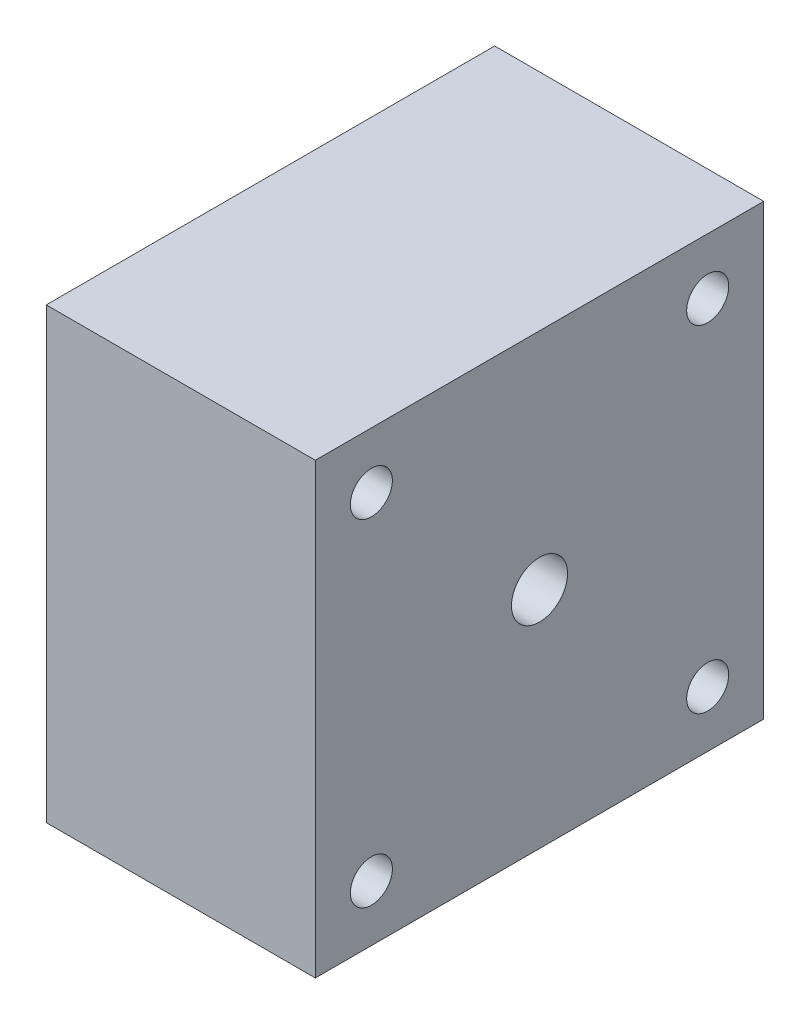
ISO-10303-21;
HEADER;
FILE_DESCRIPTION(('STEP AP214'),'2;1');
FILE_NAME('part.step','',(''),(''),'','','');
FILE_SCHEMA(('AUTOMOTIVE_DESIGN { 1 0 10303 214 1 1 1 1 }'));
ENDSEC;
DATA;
#1=APPLICATION_CONTEXT('core data for automotive mechanical design processes');
#2=APPLICATION_PROTOCOL_DEFINITION('international standard','automotive_design',2000,#1);
#3=PRODUCT_CONTEXT('',#1,'mechanical');
#4=PRODUCT('Part','Part','',(#3));
#5=PRODUCT_RELATED_PRODUCT_CATEGORY('part','',(#4));
#6=PRODUCT_DEFINITION_FORMATION('','',#4);
#7=PRODUCT_DEFINITION_CONTEXT('part definition',#1,'design');
#8=PRODUCT_DEFINITION('design','',#6,#7);
#9=PRODUCT_DEFINITION_SHAPE('','',#8);
#10=(LENGTH_UNIT() NAMED_UNIT(*) SI_UNIT(.MILLI.,.METRE.));
#11=(NAMED_UNIT(*) PLANE_ANGLE_UNIT() SI_UNIT($,.RADIAN.));
#12=(NAMED_UNIT(*) SI_UNIT($,.STERADIAN.) SOLID_ANGLE_UNIT());
#13=UNCERTAINTY_MEASURE_WITH_UNIT(LENGTH_MEASURE(1.E-05),#10,'distance_accuracy_value','');
#14=(GEOMETRIC_REPRESENTATION_CONTEXT(3) GLOBAL_UNCERTAINTY_ASSIGNED_CONTEXT((#13)) GLOBAL_UNIT_ASSIGNED_CONTEXT((#10,
#11,#12)) REPRESENTATION_CONTEXT('',''));
#15=CARTESIAN_POINT('',(0.,0.,0.));
#16=DIRECTION('',(0.,0.,1.));
#17=DIRECTION('',(1.,0.,0.));
#18=AXIS2_PLACEMENT_3D('',#15,#16,#17);
#19=CARTESIAN_POINT('',(0.,50.8,0.));
#20=DIRECTION('',(-1.,0.,0.));
#21=DIRECTION('',(0.,0.,1.));
#22=AXIS2_PLACEMENT_3D('',#19,#20,#21);
#23=PLANE('',#22);
#24=CARTESIAN_POINT('',(0.,30.1624999999995,-33.6488919710466));
#25=DIRECTION('',(-1.,0.,0.));
#26=DIRECTION('',(0.,0.,1.));
#27=AXIS2_PLACEMENT_3D('',#24,#25,#26);
#28=CIRCLE('',#27,1.8288);
#29=CARTESIAN_POINT('',(0.,30.1624999999995,-31.8200919710466));
#30=VERTEX_POINT('',#29);
#31=EDGE_CURVE('E415',#30,#30,#28,.T.);
#32=ORIENTED_EDGE('',*,*,#31,.F.);
#33=EDGE_LOOP('',(#32));
#34=FACE_BOUND('',#33,.T.);
#35=CARTESIAN_POINT('',(0.,20.6374999999995,-33.6488919710461));
#36=DIRECTION('',(-1.,0.,0.));
#37=DIRECTION('',(0.,0.,1.));
#38=AXIS2_PLACEMENT_3D('',#35,#36,#37);
#39=CIRCLE('',#38,1.8288);
#40=CARTESIAN_POINT('',(0.,20.6374999999995,-31.8200919710461));
#41=VERTEX_POINT('',#40);
#42=EDGE_CURVE('E409',#41,#41,#39,.T.);
#43=ORIENTED_EDGE('',*,*,#42,.F.);
#44=EDGE_LOOP('',(#43));
#45=FACE_BOUND('',#44,.T.);
#46=CARTESIAN_POINT('',(0.,15.8749999999999,-25.3999999999991));
#47=DIRECTION('',(-1.,0.,0.));
#48=DIRECTION('',(0.,0.,1.));
#49=AXIS2_PLACEMENT_3D('',#46,#47,#48);
#50=CIRCLE('',#49,1.8288);
#51=CARTESIAN_POINT('',(0.,15.8749999999999,-23.5711999999991));
#52=VERTEX_POINT('',#51);
#53=EDGE_CURVE('E403',#52,#52,#50,.T.);
#54=ORIENTED_EDGE('',*,*,#53,.F.);
#55=EDGE_LOOP('',(#54));
#56=FACE_BOUND('',#55,.T.);
#57=CARTESIAN_POINT('',(0.,20.6375000000003,-17.1511080289525));
#58=DIRECTION('',(-1.,0.,0.));
#59=DIRECTION('',(0.,0.,1.));
#60=AXIS2_PLACEMENT_3D('',#57,#58,#59);
#61=CIRCLE('',#60,1.8288);
#62=CARTESIAN_POINT('',(0.,20.6375000000003,-15.3223080289525));
#63=VERTEX_POINT('',#62);
#64=EDGE_CURVE('E397',#63,#63,#61,.T.);
#65=ORIENTED_EDGE('',*,*,#64,.F.);
#66=EDGE_LOOP('',(#65));
#67=FACE_BOUND('',#66,.T.);
#68=CARTESIAN_POINT('',(0.,30.1625000000003,-17.151108028953));
#69=DIRECTION('',(-1.,0.,0.));
#70=DIRECTION('',(0.,0.,1.));
#71=AXIS2_PLACEMENT_3D('',#68,#69,#70);
#72=CIRCLE('',#71,1.8288);
#73=CARTESIAN_POINT('',(0.,30.1625000000003,-15.322308028953));
#74=VERTEX_POINT('',#73);
#75=EDGE_CURVE('E388',#74,#74,#72,.T.);
#76=ORIENTED_EDGE('',*,*,#75,.F.);
#77=EDGE_LOOP('',(#76));
#78=FACE_BOUND('',#77,.T.);
#79=CARTESIAN_POINT('',(0.,34.9249999999999,-25.4));
#80=DIRECTION('',(-1.,0.,0.));
#81=DIRECTION('',(0.,0.,1.));
#82=AXIS2_PLACEMENT_3D('',#79,#80,#81);
#83=CIRCLE('',#82,1.8288);
#84=CARTESIAN_POINT('',(0.,34.9249999999999,-23.5712));
#85=VERTEX_POINT('',#84);
#86=EDGE_CURVE('E138',#85,#85,#83,.T.);
#87=ORIENTED_EDGE('',*,*,#86,.F.);
#88=EDGE_LOOP('',(#87));
#89=FACE_BOUND('',#88,.T.);
#90=CARTESIAN_POINT('',(0.,25.3999999999999,-25.4));
#91=DIRECTION('',(-1.,0.,0.));
#92=DIRECTION('',(0.,0.,1.));
#93=AXIS2_PLACEMENT_3D('',#90,#91,#92);
#94=CIRCLE('',#93,7.1501);
#95=CARTESIAN_POINT('',(0.,25.3999999999999,-18.2499));
#96=VERTEX_POINT('',#95);
#97=EDGE_CURVE('E129',#96,#96,#94,.F.);
#98=ORIENTED_EDGE('',*,*,#97,.T.);
#99=EDGE_LOOP('',(#98));
#100=FACE_BOUND('',#99,.T.);
#101=CARTESIAN_POINT('',(0.,44.45,-44.4499999999996));
#102=DIRECTION('',(-1.,0.,0.));
#103=DIRECTION('',(0.,0.,1.));
#104=AXIS2_PLACEMENT_3D('',#101,#102,#103);
#105=CIRCLE('',#104,2.38125);
#106=CARTESIAN_POINT('',(0.,44.45,-42.0687499999996));
#107=VERTEX_POINT('',#106);
#108=EDGE_CURVE('E119',#107,#107,#105,.F.);
#109=ORIENTED_EDGE('',*,*,#108,.T.);
#110=EDGE_LOOP('',(#109));
#111=FACE_BOUND('',#110,.T.);
#112=CARTESIAN_POINT('',(0.,6.35,-44.4499999999996));
#113=DIRECTION('',(-1.,0.,0.));
#114=DIRECTION('',(0.,0.,1.));
#115=AXIS2_PLACEMENT_3D('',#112,#113,#114);
#116=CIRCLE('',#115,2.38125);
#117=CARTESIAN_POINT('',(0.,6.35,-42.0687499999996));
#118=VERTEX_POINT('',#117);
#119=EDGE_CURVE('E110',#118,#118,#116,.F.);
#120=ORIENTED_EDGE('',*,*,#119,.T.);
#121=EDGE_LOOP('',(#120));
#122=FACE_BOUND('',#121,.T.);
#123=DIRECTION('',(0.,-1.,0.));
#124=VECTOR('',#123,1.);
#125=CARTESIAN_POINT('',(0.,0.,0.));
#126=LINE('',#125,#124);
#127=CARTESIAN_POINT('',(0.,50.8,0.));
#128=VERTEX_POINT('',#127);
#129=CARTESIAN_POINT('',(0.,0.,0.));
#130=VERTEX_POINT('',#129);
#131=EDGE_CURVE('E101',#128,#130,#126,.T.);
#132=ORIENTED_EDGE('',*,*,#131,.F.);
#133=DIRECTION('',(0.,0.,1.));
#134=VECTOR('',#133,1.);
#135=CARTESIAN_POINT('',(0.,50.8,0.));
#136=LINE('',#135,#134);
#137=CARTESIAN_POINT('',(0.,50.8,-50.8));
#138=VERTEX_POINT('',#137);
#139=EDGE_CURVE('E75',#138,#128,#136,.T.);
#140=ORIENTED_EDGE('',*,*,#139,.F.);
#141=DIRECTION('',(0.,1.,0.));
#142=VECTOR('',#141,1.);
#143=CARTESIAN_POINT('',(0.,0.,-50.8));
#144=LINE('',#143,#142);
#145=CARTESIAN_POINT('',(0.,0.,-50.8));
#146=VERTEX_POINT('',#145);
#147=EDGE_CURVE('E69',#146,#138,#144,.T.);
#148=ORIENTED_EDGE('',*,*,#147,.F.);
#149=DIRECTION('',(0.,0.,-1.));
#150=VECTOR('',#149,1.);
#151=CARTESIAN_POINT('',(0.,0.,0.));
#152=LINE('',#151,#150);
#153=EDGE_CURVE('E92',#130,#146,#152,.T.);
#154=ORIENTED_EDGE('',*,*,#153,.F.);
#155=EDGE_LOOP('',(#132,#140,#148,#154));
#156=FACE_BOUND('',#155,.T.);
#157=CARTESIAN_POINT('',(0.,44.45,-6.35000000000005));
#158=DIRECTION('',(-1.,0.,0.));
#159=DIRECTION('',(0.,0.,1.));
#160=AXIS2_PLACEMENT_3D('',#157,#158,#159);
#161=CIRCLE('',#160,2.38125);
#162=CARTESIAN_POINT('',(0.,44.45,-3.96875000000005));
#163=VERTEX_POINT('',#162);
#164=EDGE_CURVE('E115',#163,#163,#161,.F.);
#165=ORIENTED_EDGE('',*,*,#164,.T.);
#166=EDGE_LOOP('',(#165));
#167=FACE_BOUND('',#166,.T.);
#168=CARTESIAN_POINT('',(0.,6.35000000000001,-6.34999999999955));
#169=DIRECTION('',(-1.,0.,0.));
#170=DIRECTION('',(0.,0.,1.));
#171=AXIS2_PLACEMENT_3D('',#168,#169,#170);
#172=CIRCLE('',#171,2.38125);
#173=CARTESIAN_POINT('',(0.,6.35000000000001,-3.96874999999955));
#174=VERTEX_POINT('',#173);
#175=EDGE_CURVE('E122',#174,#174,#172,.F.);
#176=ORIENTED_EDGE('',*,*,#175,.T.);
#177=EDGE_LOOP('',(#176));
#178=FACE_BOUND('',#177,.T.);
#179=ADVANCED_FACE('F33',(#34,#45,#56,#67,#78,#89,#100,#111,#122,#156,#167,#178),#23,.T.);
#180=CARTESIAN_POINT('',(30.48,50.8,0.));
#181=DIRECTION('',(-1.,0.,0.));
#182=DIRECTION('',(0.,0.,1.));
#183=AXIS2_PLACEMENT_3D('',#180,#181,#182);
#184=PLANE('',#183);
#185=CARTESIAN_POINT('',(30.48,44.45,-44.4499999999993));
#186=DIRECTION('',(-1.,0.,0.));
#187=DIRECTION('',(0.,0.,1.));
#188=AXIS2_PLACEMENT_3D('',#185,#186,#187);
#189=CIRCLE('',#188,2.38125);
#190=CARTESIAN_POINT('',(30.48,44.45,-42.0687499999993));
#191=VERTEX_POINT('',#190);
#192=EDGE_CURVE('E118',#191,#191,#189,.F.);
#193=ORIENTED_EDGE('',*,*,#192,.F.);
#194=EDGE_LOOP('',(#193));
#195=FACE_BOUND('',#194,.T.);
#196=CARTESIAN_POINT('',(30.48,6.35,-44.4499999999994));
#197=DIRECTION('',(-1.,0.,0.));
#198=DIRECTION('',(0.,0.,1.));
#199=AXIS2_PLACEMENT_3D('',#196,#197,#198);
#200=CIRCLE('',#199,2.38125);
#201=CARTESIAN_POINT('',(30.48,6.35,-42.0687499999994));
#202=VERTEX_POINT('',#201);
#203=EDGE_CURVE('E113',#202,#202,#200,.F.);
#204=ORIENTED_EDGE('',*,*,#203,.F.);
#205=EDGE_LOOP('',(#204));
#206=FACE_BOUND('',#205,.T.);
#207=DIRECTION('',(0.,-1.,0.));
#208=VECTOR('',#207,1.);
#209=CARTESIAN_POINT('',(30.48,0.,0.));
#210=LINE('',#209,#208);
#211=CARTESIAN_POINT('',(30.48,50.8,0.));
#212=VERTEX_POINT('',#211);
#213=CARTESIAN_POINT('',(30.48,0.,0.));
#214=VERTEX_POINT('',#213);
#215=EDGE_CURVE('E88',#212,#214,#210,.T.);
#216=ORIENTED_EDGE('',*,*,#215,.T.);
#217=DIRECTION('',(0.,0.,-1.));
#218=VECTOR('',#217,1.);
#219=CARTESIAN_POINT('',(30.48,0.,0.));
#220=LINE('',#219,#218);
#221=CARTESIAN_POINT('',(30.48,0.,-50.8));
#222=VERTEX_POINT('',#221);
#223=EDGE_CURVE('E82',#214,#222,#220,.T.);
#224=ORIENTED_EDGE('',*,*,#223,.T.);
#225=DIRECTION('',(0.,1.,0.));
#226=VECTOR('',#225,1.);
#227=CARTESIAN_POINT('',(30.48,0.,-50.8));
#228=LINE('',#227,#226);
#229=CARTESIAN_POINT('',(30.48,50.8,-50.8));
#230=VERTEX_POINT('',#229);
#231=EDGE_CURVE('E86',#222,#230,#228,.T.);
#232=ORIENTED_EDGE('',*,*,#231,.T.);
#233=DIRECTION('',(0.,0.,1.));
#234=VECTOR('',#233,1.);
#235=CARTESIAN_POINT('',(30.48,50.8,0.));
#236=LINE('',#235,#234);
#237=EDGE_CURVE('E52',#230,#212,#236,.T.);
#238=ORIENTED_EDGE('',*,*,#237,.T.);
#239=EDGE_LOOP('',(#216,#224,#232,#238));
#240=FACE_BOUND('',#239,.T.);
#241=CARTESIAN_POINT('',(30.48,25.3999999999995,-25.3999999999984));
#242=DIRECTION('',(-1.,0.,0.));
#243=DIRECTION('',(0.,0.,1.));
#244=AXIS2_PLACEMENT_3D('',#241,#242,#243);
#245=CIRCLE('',#244,3.175);
#246=CARTESIAN_POINT('',(30.48,26.7918357861166,-28.2536674901738));
#247=VERTEX_POINT('',#246);
#248=EDGE_CURVE('E104',#247,#247,#245,.F.);
#249=ORIENTED_EDGE('',*,*,#248,.F.);
#250=EDGE_LOOP('',(#249));
#251=FACE_BOUND('',#250,.T.);
#252=CARTESIAN_POINT('',(30.48,44.45,-6.35000000000005));
#253=DIRECTION('',(-1.,0.,0.));
#254=DIRECTION('',(0.,0.,1.));
#255=AXIS2_PLACEMENT_3D('',#252,#253,#254);
#256=CIRCLE('',#255,2.38125);
#257=CARTESIAN_POINT('',(30.48,44.45,-3.96875000000005));
#258=VERTEX_POINT('',#257);
#259=EDGE_CURVE('E114',#258,#258,#256,.F.);
#260=ORIENTED_EDGE('',*,*,#259,.F.);
#261=EDGE_LOOP('',(#260));
#262=FACE_BOUND('',#261,.T.);
#263=CARTESIAN_POINT('',(30.48,6.35000000000001,-6.34999999999935));
#264=DIRECTION('',(-1.,0.,0.));
#265=DIRECTION('',(0.,0.,1.));
#266=AXIS2_PLACEMENT_3D('',#263,#264,#265);
#267=CIRCLE('',#266,2.38125);
#268=CARTESIAN_POINT('',(30.48,6.35000000000001,-3.96874999999935));
#269=VERTEX_POINT('',#268);
#270=EDGE_CURVE('E121',#269,#269,#267,.F.);
#271=ORIENTED_EDGE('',*,*,#270,.F.);
#272=EDGE_LOOP('',(#271));
#273=FACE_BOUND('',#272,.T.);
#274=ADVANCED_FACE('F83',(#195,#206,#240,#251,#262,#273),#184,.F.);
#275=CARTESIAN_POINT('',(30.48,0.,0.));
#276=DIRECTION('',(0.,0.,-1.));
#277=DIRECTION('',(-1.,0.,0.));
#278=AXIS2_PLACEMENT_3D('',#275,#276,#277);
#279=PLANE('',#278);
#280=ORIENTED_EDGE('',*,*,#131,.T.);
#281=DIRECTION('',(-1.,0.,0.));
#282=VECTOR('',#281,1.);
#283=CARTESIAN_POINT('',(30.48,0.,0.));
#284=LINE('',#283,#282);
#285=EDGE_CURVE('E11',#214,#130,#284,.T.);
#286=ORIENTED_EDGE('',*,*,#285,.F.);
#287=ORIENTED_EDGE('',*,*,#215,.F.);
#288=DIRECTION('',(-1.,0.,0.));
#289=VECTOR('',#288,1.);
#290=CARTESIAN_POINT('',(30.48,50.8,0.));
#291=LINE('',#290,#289);
#292=EDGE_CURVE('E97',#212,#128,#291,.T.);
#293=ORIENTED_EDGE('',*,*,#292,.T.);
#294=EDGE_LOOP('',(#280,#286,#287,#293));
#295=FACE_BOUND('',#294,.T.);
#296=ADVANCED_FACE('F35',(#295),#279,.F.);
#297=CARTESIAN_POINT('',(30.48,0.,0.));
#298=DIRECTION('',(0.,1.,0.));
#299=DIRECTION('',(0.,0.,1.));
#300=AXIS2_PLACEMENT_3D('',#297,#298,#299);
#301=PLANE('',#300);
#302=ORIENTED_EDGE('',*,*,#153,.T.);
#303=DIRECTION('',(-1.,0.,0.));
#304=VECTOR('',#303,1.);
#305=CARTESIAN_POINT('',(30.48,0.,-50.8));
#306=LINE('',#305,#304);
#307=EDGE_CURVE('E43',#222,#146,#306,.T.);
#308=ORIENTED_EDGE('',*,*,#307,.F.);
#309=ORIENTED_EDGE('',*,*,#223,.F.);
#310=ORIENTED_EDGE('',*,*,#285,.T.);
#311=EDGE_LOOP('',(#302,#308,#309,#310));
#312=FACE_BOUND('',#311,.T.);
#313=ADVANCED_FACE('F91',(#312),#301,.F.);
#314=CARTESIAN_POINT('',(30.48,0.,-50.8));
#315=DIRECTION('',(0.,0.,1.));
#316=DIRECTION('',(1.,0.,0.));
#317=AXIS2_PLACEMENT_3D('',#314,#315,#316);
#318=PLANE('',#317);
#319=ORIENTED_EDGE('',*,*,#147,.T.);
#320=DIRECTION('',(-1.,0.,0.));
#321=VECTOR('',#320,1.);
#322=CARTESIAN_POINT('',(30.48,50.8,-50.8));
#323=LINE('',#322,#321);
#324=EDGE_CURVE('E93',#230,#138,#323,.T.);
#325=ORIENTED_EDGE('',*,*,#324,.F.);
#326=ORIENTED_EDGE('',*,*,#231,.F.);
#327=ORIENTED_EDGE('',*,*,#307,.T.);
#328=EDGE_LOOP('',(#319,#325,#326,#327));
#329=FACE_BOUND('',#328,.T.);
#330=ADVANCED_FACE('F95',(#329),#318,.F.);
#331=CARTESIAN_POINT('',(30.48,50.8,0.));
#332=DIRECTION('',(0.,-1.,0.));
#333=DIRECTION('',(0.,0.,-1.));
#334=AXIS2_PLACEMENT_3D('',#331,#332,#333);
#335=PLANE('',#334);
#336=ORIENTED_EDGE('',*,*,#139,.T.);
#337=ORIENTED_EDGE('',*,*,#292,.F.);
#338=ORIENTED_EDGE('',*,*,#237,.F.);
#339=ORIENTED_EDGE('',*,*,#324,.T.);
#340=EDGE_LOOP('',(#336,#337,#338,#339));
#341=FACE_BOUND('',#340,.T.);
#342=ADVANCED_FACE('F185',(#341),#335,.F.);
#343=CARTESIAN_POINT('',(-48.3234802369888,25.3999999999995,-25.3999999999984));
#344=DIRECTION('',(1.,0.,0.));
#345=DIRECTION('',(0.,0.438373475942388,-0.898792910291458));
#346=AXIS2_PLACEMENT_3D('',#343,#344,#345);
#347=CYLINDRICAL_SURFACE('',#346,3.175);
#348=CARTESIAN_POINT('',(24.13,25.3999999999995,-25.3999999999984));
#349=DIRECTION('',(1.,0.,0.));
#350=DIRECTION('',(0.,0.,-1.));
#351=AXIS2_PLACEMENT_3D('',#348,#349,#350);
#352=CIRCLE('',#351,3.175);
#353=CARTESIAN_POINT('',(24.13,26.7918357861166,-28.2536674901738));
#354=VERTEX_POINT('',#353);
#355=EDGE_CURVE('E37',#354,#354,#352,.T.);
#356=CARTESIAN_POINT('',(24.13,26.7918357861166,-28.2536674901738));
#357=CARTESIAN_POINT('',(24.1961458333333,26.7918357861166,-28.2536674901738));
#358=CARTESIAN_POINT('',(24.2622916666667,26.7918357861166,-28.2536674901738));
#359=CARTESIAN_POINT('',(24.3945833333333,26.7918357861166,-28.2536674901738));
#360=CARTESIAN_POINT('',(24.4607291666667,26.7918357861166,-28.2536674901738));
#361=CARTESIAN_POINT('',(24.5930208333334,26.7918357861166,-28.2536674901738));
#362=CARTESIAN_POINT('',(24.6591666666667,26.7918357861166,-28.2536674901738));
#363=CARTESIAN_POINT('',(24.7914583333333,26.7918357861166,-28.2536674901738));
#364=CARTESIAN_POINT('',(24.8576041666667,26.7918357861166,-28.2536674901738));
#365=CARTESIAN_POINT('',(24.9898958333333,26.7918357861166,-28.2536674901738));
#366=CARTESIAN_POINT('',(25.0560416666667,26.7918357861166,-28.2536674901738));
#367=CARTESIAN_POINT('',(25.1883333333334,26.7918357861166,-28.2536674901738));
#368=CARTESIAN_POINT('',(25.2544791666667,26.7918357861166,-28.2536674901738));
#369=CARTESIAN_POINT('',(25.3867708333333,26.7918357861166,-28.2536674901738));
#370=CARTESIAN_POINT('',(25.4529166666667,26.7918357861166,-28.2536674901738));
#371=CARTESIAN_POINT('',(25.5852083333333,26.7918357861166,-28.2536674901738));
#372=CARTESIAN_POINT('',(25.6513541666667,26.7918357861166,-28.2536674901738));
#373=CARTESIAN_POINT('',(25.7836458333333,26.7918357861166,-28.2536674901738));
#374=CARTESIAN_POINT('',(25.8497916666667,26.7918357861166,-28.2536674901738));
#375=CARTESIAN_POINT('',(25.9820833333333,26.7918357861166,-28.2536674901738));
#376=CARTESIAN_POINT('',(26.0482291666667,26.7918357861166,-28.2536674901738));
#377=CARTESIAN_POINT('',(26.1805208333333,26.7918357861166,-28.2536674901738));
#378=CARTESIAN_POINT('',(26.2466666666667,26.7918357861166,-28.2536674901738));
#379=CARTESIAN_POINT('',(26.3789583333333,26.7918357861166,-28.2536674901738));
#380=CARTESIAN_POINT('',(26.4451041666667,26.7918357861166,-28.2536674901738));
#381=CARTESIAN_POINT('',(26.5773958333333,26.7918357861166,-28.2536674901738));
#382=CARTESIAN_POINT('',(26.6435416666667,26.7918357861166,-28.2536674901738));
#383=CARTESIAN_POINT('',(26.7758333333333,26.7918357861166,-28.2536674901738));
#384=CARTESIAN_POINT('',(26.8419791666667,26.7918357861166,-28.2536674901738));
#385=CARTESIAN_POINT('',(26.9742708333333,26.7918357861166,-28.2536674901738));
#386=CARTESIAN_POINT('',(27.0404166666667,26.7918357861166,-28.2536674901738));
#387=CARTESIAN_POINT('',(27.1727083333333,26.7918357861166,-28.2536674901738));
#388=CARTESIAN_POINT('',(27.2388541666667,26.7918357861166,-28.2536674901738));
#389=CARTESIAN_POINT('',(27.3711458333333,26.7918357861166,-28.2536674901738));
#390=CARTESIAN_POINT('',(27.4372916666667,26.7918357861166,-28.2536674901738));
#391=CARTESIAN_POINT('',(27.5695833333333,26.7918357861166,-28.2536674901738));
#392=CARTESIAN_POINT('',(27.6357291666667,26.7918357861166,-28.2536674901738));
#393=CARTESIAN_POINT('',(27.7680208333333,26.7918357861166,-28.2536674901738));
#394=CARTESIAN_POINT('',(27.8341666666667,26.7918357861166,-28.2536674901738));
#395=CARTESIAN_POINT('',(27.9664583333333,26.7918357861166,-28.2536674901738));
#396=CARTESIAN_POINT('',(28.0326041666667,26.7918357861166,-28.2536674901738));
#397=CARTESIAN_POINT('',(28.1648958333333,26.7918357861166,-28.2536674901738));
#398=CARTESIAN_POINT('',(28.2310416666667,26.7918357861166,-28.2536674901738));
#399=CARTESIAN_POINT('',(28.3633333333333,26.7918357861166,-28.2536674901738));
#400=CARTESIAN_POINT('',(28.4294791666667,26.7918357861166,-28.2536674901738));
#401=CARTESIAN_POINT('',(28.5617708333333,26.7918357861166,-28.2536674901738));
#402=CARTESIAN_POINT('',(28.6279166666667,26.7918357861166,-28.2536674901738));
#403=CARTESIAN_POINT('',(28.7602083333333,26.7918357861166,-28.2536674901738));
#404=CARTESIAN_POINT('',(28.8263541666667,26.7918357861166,-28.2536674901738));
#405=CARTESIAN_POINT('',(28.9586458333333,26.7918357861166,-28.2536674901738));
#406=CARTESIAN_POINT('',(29.0247916666667,26.7918357861166,-28.2536674901738));
#407=CARTESIAN_POINT('',(29.1570833333333,26.7918357861166,-28.2536674901738));
#408=CARTESIAN_POINT('',(29.2232291666667,26.7918357861166,-28.2536674901738));
#409=CARTESIAN_POINT('',(29.3555208333333,26.7918357861166,-28.2536674901738));
#410=CARTESIAN_POINT('',(29.4216666666667,26.7918357861166,-28.2536674901738));
#411=CARTESIAN_POINT('',(29.5539583333333,26.7918357861166,-28.2536674901738));
#412=CARTESIAN_POINT('',(29.6201041666667,26.7918357861166,-28.2536674901738));
#413=CARTESIAN_POINT('',(29.7523958333333,26.7918357861166,-28.2536674901738));
#414=CARTESIAN_POINT('',(29.8185416666667,26.7918357861166,-28.2536674901738));
#415=CARTESIAN_POINT('',(29.9508333333333,26.7918357861166,-28.2536674901738));
#416=CARTESIAN_POINT('',(30.0169791666667,26.7918357861166,-28.2536674901738));
#417=CARTESIAN_POINT('',(30.1492708333333,26.7918357861166,-28.2536674901738));
#418=CARTESIAN_POINT('',(30.2154166666667,26.7918357861166,-28.2536674901738));
#419=CARTESIAN_POINT('',(30.3477083333333,26.7918357861166,-28.2536674901738));
#420=CARTESIAN_POINT('',(30.4138541666667,26.7918357861166,-28.2536674901738));
#421=CARTESIAN_POINT('',(30.48,26.7918357861166,-28.2536674901738));
#422=B_SPLINE_CURVE_WITH_KNOTS('',3,(#356,#357,#358,#359,#360,#361,#362,#363,#364,#365,#366,
#367,#368,#369,#370,#371,#372,#373,#374,#375,#376,#377,#378,#379,#380,#381,#382,#383,#384,#385,
#386,#387,#388,#389,#390,#391,#392,#393,#394,#395,#396,#397,#398,#399,#400,#401,#402,#403,#404,
#405,#406,#407,#408,#409,#410,#411,#412,#413,#414,#415,#416,#417,#418,#419,#420,#421),
.UNSPECIFIED.,.F.,.F.,(4,2,2,2,2,2,2,2,2,2,2,2,2,2,2,2,2,2,2,2,2,2,2,2,2,2,2,2,2,2,2,2,4),(0.,
0.198437499999995,0.396875000000005,0.5953125,0.793749999999996,0.992187500000005,1.190625,
1.3890625,1.58749999999999,1.7859375,1.984375,2.18281249999999,2.38125,2.5796875,
2.77812499999999,2.9765625,3.175,3.37343749999999,3.571875,3.7703125,3.96874999999999,4.1671875,
4.365625,4.56406249999999,4.7625,4.9609375,5.15937499999999,5.35781249999999,5.55625,
5.75468749999999,5.95312499999999,6.1515625,6.34999999999999),.UNSPECIFIED.);
#423=EDGE_CURVE('BSEAM151',#354,#247,#422,.T.);
#424=ORIENTED_EDGE('',*,*,#355,.F.);
#425=ORIENTED_EDGE('',*,*,#248,.T.);
#426=ORIENTED_EDGE('',*,*,#423,.T.);
#427=ORIENTED_EDGE('',*,*,#423,.F.);
#428=EDGE_LOOP('',(#424,#426,#425,#427));
#429=FACE_BOUND('',#428,.T.);
#430=ADVANCED_FACE('F151',(#429),#347,.F.);
#431=CARTESIAN_POINT('',(-81.0894802369712,6.35000000000001,-44.4500000000001));
#432=DIRECTION('',(1.,0.,0.));
#433=DIRECTION('',(0.,0.71121192391603,-0.70297766627373));
#434=AXIS2_PLACEMENT_3D('',#431,#432,#433);
#435=CYLINDRICAL_SURFACE('',#434,2.38125);
#436=ORIENTED_EDGE('',*,*,#119,.F.);
#437=EDGE_LOOP('',(#436));
#438=FACE_BOUND('',#437,.T.);
#439=ORIENTED_EDGE('',*,*,#203,.T.);
#440=EDGE_LOOP('',(#439));
#441=FACE_BOUND('',#440,.T.);
#442=ADVANCED_FACE('F203',(#438,#441),#435,.F.);
#443=CARTESIAN_POINT('',(-81.0894802369721,44.45,-6.35000000000005));
#444=DIRECTION('',(1.,0.,0.));
#445=DIRECTION('',(0.,0.52642426037138,0.850222028703353));
#446=AXIS2_PLACEMENT_3D('',#443,#444,#445);
#447=CYLINDRICAL_SURFACE('',#446,2.38125);
#448=ORIENTED_EDGE('',*,*,#164,.F.);
#449=EDGE_LOOP('',(#448));
#450=FACE_BOUND('',#449,.T.);
#451=ORIENTED_EDGE('',*,*,#259,.T.);
#452=EDGE_LOOP('',(#451));
#453=FACE_BOUND('',#452,.T.);
#454=ADVANCED_FACE('F172',(#450,#453),#447,.F.);
#455=CARTESIAN_POINT('',(-81.0894802369712,44.45,-44.4500000000001));
#456=DIRECTION('',(1.,0.,0.));
#457=DIRECTION('',(0.,-0.82075836964807,-0.571275501533753));
#458=AXIS2_PLACEMENT_3D('',#455,#456,#457);
#459=CYLINDRICAL_SURFACE('',#458,2.38125);
#460=ORIENTED_EDGE('',*,*,#108,.F.);
#461=EDGE_LOOP('',(#460));
#462=FACE_BOUND('',#461,.T.);
#463=ORIENTED_EDGE('',*,*,#192,.T.);
#464=EDGE_LOOP('',(#463));
#465=FACE_BOUND('',#464,.T.);
#466=ADVANCED_FACE('F163',(#462,#465),#459,.F.);
#467=CARTESIAN_POINT('',(-81.0894802369714,6.35000000000002,-6.35000000000009));
#468=DIRECTION('',(1.,0.,0.));
#469=DIRECTION('',(0.,0.,-1.));
#470=AXIS2_PLACEMENT_3D('',#467,#468,#469);
#471=CYLINDRICAL_SURFACE('',#470,2.38125);
#472=ORIENTED_EDGE('',*,*,#175,.F.);
#473=EDGE_LOOP('',(#472));
#474=FACE_BOUND('',#473,.T.);
#475=ORIENTED_EDGE('',*,*,#270,.T.);
#476=EDGE_LOOP('',(#475));
#477=FACE_BOUND('',#476,.T.);
#478=ADVANCED_FACE('F160',(#474,#477),#471,.F.);
#479=CARTESIAN_POINT('',(24.13,25.3999999999999,-25.3999999999998));
#480=DIRECTION('',(1.,0.,0.));
#481=DIRECTION('',(0.,0.,-1.));
#482=AXIS2_PLACEMENT_3D('',#479,#480,#481);
#483=PLANE('',#482);
#484=ORIENTED_EDGE('',*,*,#355,.T.);
#485=EDGE_LOOP('',(#484));
#486=FACE_BOUND('',#485,.T.);
#487=CARTESIAN_POINT('',(24.13,25.3999999999999,-25.3999999999998));
#488=DIRECTION('',(1.,0.,0.));
#489=DIRECTION('',(0.,0.,-1.));
#490=AXIS2_PLACEMENT_3D('',#487,#488,#489);
#491=CIRCLE('',#490,7.1501);
#492=CARTESIAN_POINT('',(24.13,25.3999999999999,-18.2498999999998));
#493=VERTEX_POINT('',#492);
#494=EDGE_CURVE('E133',#493,#493,#491,.T.);
#495=ORIENTED_EDGE('',*,*,#494,.F.);
#496=EDGE_LOOP('',(#495));
#497=FACE_BOUND('',#496,.T.);
#498=ADVANCED_FACE('F162',(#486,#497),#483,.F.);
#499=CARTESIAN_POINT('',(24.13,25.3999999999999,-25.3999999999998));
#500=DIRECTION('',(-1.,0.,0.));
#501=DIRECTION('',(0.,0.,1.));
#502=AXIS2_PLACEMENT_3D('',#499,#500,#501);
#503=CYLINDRICAL_SURFACE('',#502,7.1501);
#504=CARTESIAN_POINT('',(24.13,25.3999999999999,-18.2498999999998));
#505=CARTESIAN_POINT('',(23.8786458333333,25.3999999999999,-18.2498999999998));
#506=CARTESIAN_POINT('',(23.6272916666666,25.3999999999999,-18.2498999999998));
#507=CARTESIAN_POINT('',(23.1245833333333,25.3999999999999,-18.2498999999999));
#508=CARTESIAN_POINT('',(22.8732291666666,25.3999999999999,-18.2498999999999));
#509=CARTESIAN_POINT('',(22.3705208333333,25.3999999999999,-18.2498999999999));
#510=CARTESIAN_POINT('',(22.1191666666666,25.3999999999999,-18.2498999999999));
#511=CARTESIAN_POINT('',(21.6164583333333,25.3999999999999,-18.2498999999999));
#512=CARTESIAN_POINT('',(21.3651041666666,25.3999999999999,-18.2498999999999));
#513=CARTESIAN_POINT('',(20.8623958333333,25.3999999999999,-18.2498999999999));
#514=CARTESIAN_POINT('',(20.6110416666666,25.3999999999999,-18.2498999999999));
#515=CARTESIAN_POINT('',(20.1083333333333,25.3999999999999,-18.2498999999999));
#516=CARTESIAN_POINT('',(19.8569791666666,25.3999999999999,-18.2498999999999));
#517=CARTESIAN_POINT('',(19.3542708333333,25.3999999999999,-18.2498999999999));
#518=CARTESIAN_POINT('',(19.1029166666666,25.3999999999999,-18.2498999999999));
#519=CARTESIAN_POINT('',(18.6002083333333,25.3999999999999,-18.2498999999999));
#520=CARTESIAN_POINT('',(18.3488541666666,25.3999999999999,-18.2498999999999));
#521=CARTESIAN_POINT('',(17.8461458333333,25.3999999999999,-18.2498999999999));
#522=CARTESIAN_POINT('',(17.5947916666666,25.3999999999999,-18.2498999999999));
#523=CARTESIAN_POINT('',(17.0920833333333,25.3999999999999,-18.2498999999999));
#524=CARTESIAN_POINT('',(16.8407291666666,25.3999999999999,-18.2498999999999));
#525=CARTESIAN_POINT('',(16.3380208333333,25.3999999999999,-18.2498999999999));
#526=CARTESIAN_POINT('',(16.0866666666666,25.3999999999999,-18.2498999999999));
#527=CARTESIAN_POINT('',(15.5839583333333,25.3999999999999,-18.2498999999999));
#528=CARTESIAN_POINT('',(15.3326041666666,25.3999999999999,-18.2498999999999));
#529=CARTESIAN_POINT('',(14.8298958333333,25.3999999999999,-18.2498999999999));
#530=CARTESIAN_POINT('',(14.5785416666666,25.3999999999999,-18.2498999999999));
#531=CARTESIAN_POINT('',(14.0758333333333,25.3999999999999,-18.2498999999999));
#532=CARTESIAN_POINT('',(13.8244791666666,25.3999999999999,-18.2498999999999));
#533=CARTESIAN_POINT('',(13.3217708333333,25.3999999999999,-18.2498999999999));
#534=CARTESIAN_POINT('',(13.0704166666666,25.3999999999999,-18.2498999999999));
#535=CARTESIAN_POINT('',(12.5677083333333,25.3999999999999,-18.2498999999999));
#536=CARTESIAN_POINT('',(12.3163541666666,25.3999999999999,-18.2498999999999));
#537=CARTESIAN_POINT('',(11.8136458333333,25.3999999999999,-18.2498999999999));
#538=CARTESIAN_POINT('',(11.5622916666666,25.3999999999999,-18.2498999999999));
#539=CARTESIAN_POINT('',(11.0595833333333,25.3999999999999,-18.2498999999999));
#540=CARTESIAN_POINT('',(10.8082291666666,25.3999999999999,-18.2498999999999));
#541=CARTESIAN_POINT('',(10.3055208333333,25.3999999999999,-18.2498999999999));
#542=CARTESIAN_POINT('',(10.0541666666666,25.3999999999999,-18.2498999999999));
#543=CARTESIAN_POINT('',(9.55145833333329,25.3999999999999,-18.2498999999999));
#544=CARTESIAN_POINT('',(9.30010416666663,25.3999999999999,-18.2498999999999));
#545=CARTESIAN_POINT('',(8.79739583333329,25.3999999999999,-18.2499));
#546=CARTESIAN_POINT('',(8.54604166666663,25.3999999999999,-18.2499));
#547=CARTESIAN_POINT('',(8.0433333333333,25.3999999999999,-18.2499));
#548=CARTESIAN_POINT('',(7.79197916666663,25.3999999999999,-18.2499));
#549=CARTESIAN_POINT('',(7.2892708333333,25.3999999999999,-18.2499));
#550=CARTESIAN_POINT('',(7.03791666666663,25.3999999999999,-18.2499));
#551=CARTESIAN_POINT('',(6.5352083333333,25.3999999999999,-18.2499));
#552=CARTESIAN_POINT('',(6.28385416666663,25.3999999999999,-18.2499));
#553=CARTESIAN_POINT('',(5.7811458333333,25.3999999999999,-18.2499));
#554=CARTESIAN_POINT('',(5.52979166666663,25.3999999999999,-18.2499));
#555=CARTESIAN_POINT('',(5.0270833333333,25.3999999999999,-18.2499));
#556=CARTESIAN_POINT('',(4.77572916666663,25.3999999999999,-18.2499));
#557=CARTESIAN_POINT('',(4.2730208333333,25.3999999999999,-18.2499));
#558=CARTESIAN_POINT('',(4.02166666666663,25.3999999999999,-18.2499));
#559=CARTESIAN_POINT('',(3.5189583333333,25.3999999999999,-18.2499));
#560=CARTESIAN_POINT('',(3.26760416666663,25.3999999999999,-18.2499));
#561=CARTESIAN_POINT('',(2.7648958333333,25.3999999999999,-18.2499));
#562=CARTESIAN_POINT('',(2.51354166666663,25.3999999999999,-18.2499));
#563=CARTESIAN_POINT('',(2.01083333333329,25.3999999999999,-18.2499));
#564=CARTESIAN_POINT('',(1.75947916666663,25.3999999999999,-18.2499));
#565=CARTESIAN_POINT('',(1.25677083333329,25.3999999999999,-18.2499));
#566=CARTESIAN_POINT('',(1.00541666666663,25.3999999999999,-18.2499));
#567=CARTESIAN_POINT('',(0.502708333333295,25.3999999999999,-18.2499));
#568=CARTESIAN_POINT('',(0.251354166666628,25.3999999999999,-18.2499));
#569=CARTESIAN_POINT('',(0.,25.3999999999999,-18.2499));
#570=B_SPLINE_CURVE_WITH_KNOTS('',3,(#504,#505,#506,#507,#508,#509,#510,#511,#512,#513,#514,
#515,#516,#517,#518,#519,#520,#521,#522,#523,#524,#525,#526,#527,#528,#529,#530,#531,#532,#533,
#534,#535,#536,#537,#538,#539,#540,#541,#542,#543,#544,#545,#546,#547,#548,#549,#550,#551,#552,
#553,#554,#555,#556,#557,#558,#559,#560,#561,#562,#563,#564,#565,#566,#567,#568,#569),
.UNSPECIFIED.,.F.,.F.,(4,2,2,2,2,2,2,2,2,2,2,2,2,2,2,2,2,2,2,2,2,2,2,2,2,2,2,2,2,2,2,2,4),(0.,
0.754062500000003,1.508125,2.2621875,3.01625,3.7703125,4.524375,5.2784375,6.0325,6.7865625,
7.540625,8.2946875,9.04875,9.8028125,10.556875,11.3109375,12.065,12.8190625,13.573125,
14.3271875,15.08125,15.8353125,16.589375,17.3434375,18.0975,18.8515625,19.605625,20.3596875,
21.11375,21.8678125,22.621875,23.3759375,24.13),.UNSPECIFIED.);
#571=EDGE_CURVE('BSEAM170',#493,#96,#570,.T.);
#572=ORIENTED_EDGE('',*,*,#494,.T.);
#573=ORIENTED_EDGE('',*,*,#97,.F.);
#574=ORIENTED_EDGE('',*,*,#571,.T.);
#575=ORIENTED_EDGE('',*,*,#571,.F.);
#576=EDGE_LOOP('',(#572,#574,#573,#575));
#577=FACE_BOUND('',#576,.T.);
#578=ADVANCED_FACE('F170',(#577),#503,.F.);
#579=CARTESIAN_POINT('',(13.0048000000001,30.1624999999995,-33.6488919710465));
#580=DIRECTION('',(-1.,0.,0.));
#581=DIRECTION('',(0.,0.,1.));
#582=AXIS2_PLACEMENT_3D('',#579,#580,#581);
#583=PLANE('',#582);
#584=CARTESIAN_POINT('',(13.0048000000001,30.1624999999995,-33.6488919710465));
#585=DIRECTION('',(-1.,0.,0.));
#586=DIRECTION('',(0.,0.,1.));
#587=AXIS2_PLACEMENT_3D('',#584,#585,#586);
#588=CIRCLE('',#587,1.8288);
#589=CARTESIAN_POINT('',(13.0048,30.1624999999995,-31.8200919710465));
#590=VERTEX_POINT('',#589);
#591=EDGE_CURVE('E418',#590,#590,#588,.T.);
#592=ORIENTED_EDGE('',*,*,#591,.T.);
#593=EDGE_LOOP('',(#592));
#594=FACE_BOUND('',#593,.T.);
#595=ADVANCED_FACE('F262',(#594),#583,.T.);
#596=CARTESIAN_POINT('',(13.0048000000001,30.1624999999995,-33.6488919710465));
#597=DIRECTION('',(-1.,0.,0.));
#598=DIRECTION('',(0.,0.,1.));
#599=AXIS2_PLACEMENT_3D('',#596,#597,#598);
#600=CYLINDRICAL_SURFACE('',#599,1.8288);
#601=ORIENTED_EDGE('',*,*,#591,.F.);
#602=EDGE_LOOP('',(#601));
#603=FACE_BOUND('',#602,.T.);
#604=ORIENTED_EDGE('',*,*,#31,.T.);
#605=EDGE_LOOP('',(#604));
#606=FACE_BOUND('',#605,.T.);
#607=ADVANCED_FACE('F270',(#603,#606),#600,.F.);
#608=CARTESIAN_POINT('',(13.0048000000001,20.6374999999995,-33.648891971046));
#609=DIRECTION('',(-1.,0.,0.));
#610=DIRECTION('',(0.,0.,1.));
#611=AXIS2_PLACEMENT_3D('',#608,#609,#610);
#612=PLANE('',#611);
#613=CARTESIAN_POINT('',(13.0048000000001,20.6374999999995,-33.648891971046));
#614=DIRECTION('',(-1.,0.,0.));
#615=DIRECTION('',(0.,0.,1.));
#616=AXIS2_PLACEMENT_3D('',#613,#614,#615);
#617=CIRCLE('',#616,1.8288);
#618=CARTESIAN_POINT('',(13.0048,20.6374999999995,-31.820091971046));
#619=VERTEX_POINT('',#618);
#620=EDGE_CURVE('E412',#619,#619,#617,.T.);
#621=ORIENTED_EDGE('',*,*,#620,.T.);
#622=EDGE_LOOP('',(#621));
#623=FACE_BOUND('',#622,.T.);
#624=ADVANCED_FACE('F279',(#623),#612,.T.);
#625=CARTESIAN_POINT('',(13.0048000000001,20.6374999999995,-33.648891971046));
#626=DIRECTION('',(-1.,0.,0.));
#627=DIRECTION('',(0.,0.,1.));
#628=AXIS2_PLACEMENT_3D('',#625,#626,#627);
#629=CYLINDRICAL_SURFACE('',#628,1.8288);
#630=ORIENTED_EDGE('',*,*,#620,.F.);
#631=EDGE_LOOP('',(#630));
#632=FACE_BOUND('',#631,.T.);
#633=ORIENTED_EDGE('',*,*,#42,.T.);
#634=EDGE_LOOP('',(#633));
#635=FACE_BOUND('',#634,.T.);
#636=ADVANCED_FACE('F288',(#632,#635),#629,.F.);
#637=CARTESIAN_POINT('',(13.0048,15.8749999999999,-25.399999999999));
#638=DIRECTION('',(-1.,0.,0.));
#639=DIRECTION('',(0.,0.,1.));
#640=AXIS2_PLACEMENT_3D('',#637,#638,#639);
#641=PLANE('',#640);
#642=CARTESIAN_POINT('',(13.0048,15.8749999999999,-25.399999999999));
#643=DIRECTION('',(-1.,0.,0.));
#644=DIRECTION('',(0.,0.,1.));
#645=AXIS2_PLACEMENT_3D('',#642,#643,#644);
#646=CIRCLE('',#645,1.8288);
#647=CARTESIAN_POINT('',(13.0048,15.8749999999999,-23.571199999999));
#648=VERTEX_POINT('',#647);
#649=EDGE_CURVE('E406',#648,#648,#646,.T.);
#650=ORIENTED_EDGE('',*,*,#649,.T.);
#651=EDGE_LOOP('',(#650));
#652=FACE_BOUND('',#651,.T.);
#653=ADVANCED_FACE('F297',(#652),#641,.T.);
#654=CARTESIAN_POINT('',(13.0048,15.8749999999999,-25.399999999999));
#655=DIRECTION('',(-1.,0.,0.));
#656=DIRECTION('',(0.,0.,1.));
#657=AXIS2_PLACEMENT_3D('',#654,#655,#656);
#658=CYLINDRICAL_SURFACE('',#657,1.8288);
#659=ORIENTED_EDGE('',*,*,#649,.F.);
#660=EDGE_LOOP('',(#659));
#661=FACE_BOUND('',#660,.T.);
#662=ORIENTED_EDGE('',*,*,#53,.T.);
#663=EDGE_LOOP('',(#662));
#664=FACE_BOUND('',#663,.T.);
#665=ADVANCED_FACE('F306',(#661,#664),#658,.F.);
#666=CARTESIAN_POINT('',(13.0047999999999,20.6375000000003,-17.1511080289524));
#667=DIRECTION('',(-1.,0.,0.));
#668=DIRECTION('',(0.,0.,1.));
#669=AXIS2_PLACEMENT_3D('',#666,#667,#668);
#670=PLANE('',#669);
#671=CARTESIAN_POINT('',(13.0047999999999,20.6375000000003,-17.1511080289524));
#672=DIRECTION('',(-1.,0.,0.));
#673=DIRECTION('',(0.,0.,1.));
#674=AXIS2_PLACEMENT_3D('',#671,#672,#673);
#675=CIRCLE('',#674,1.8288);
#676=CARTESIAN_POINT('',(13.0047999999999,20.6375000000003,-15.3223080289524));
#677=VERTEX_POINT('',#676);
#678=EDGE_CURVE('E400',#677,#677,#675,.T.);
#679=ORIENTED_EDGE('',*,*,#678,.T.);
#680=EDGE_LOOP('',(#679));
#681=FACE_BOUND('',#680,.T.);
#682=ADVANCED_FACE('F315',(#681),#670,.T.);
#683=CARTESIAN_POINT('',(13.0047999999999,20.6375000000003,-17.1511080289524));
#684=DIRECTION('',(-1.,0.,0.));
#685=DIRECTION('',(0.,0.,1.));
#686=AXIS2_PLACEMENT_3D('',#683,#684,#685);
#687=CYLINDRICAL_SURFACE('',#686,1.8288);
#688=ORIENTED_EDGE('',*,*,#678,.F.);
#689=EDGE_LOOP('',(#688));
#690=FACE_BOUND('',#689,.T.);
#691=ORIENTED_EDGE('',*,*,#64,.T.);
#692=EDGE_LOOP('',(#691));
#693=FACE_BOUND('',#692,.T.);
#694=ADVANCED_FACE('F324',(#690,#693),#687,.F.);
#695=CARTESIAN_POINT('',(13.0047999999999,30.1625000000003,-17.1511080289529));
#696=DIRECTION('',(-1.,0.,0.));
#697=DIRECTION('',(0.,0.,1.));
#698=AXIS2_PLACEMENT_3D('',#695,#696,#697);
#699=PLANE('',#698);
#700=CARTESIAN_POINT('',(13.0047999999999,30.1625000000003,-17.1511080289529));
#701=DIRECTION('',(-1.,0.,0.));
#702=DIRECTION('',(0.,0.,1.));
#703=AXIS2_PLACEMENT_3D('',#700,#701,#702);
#704=CIRCLE('',#703,1.8288);
#705=CARTESIAN_POINT('',(13.0047999999999,30.1625000000003,-15.3223080289529));
#706=VERTEX_POINT('',#705);
#707=EDGE_CURVE('E392',#706,#706,#704,.T.);
#708=ORIENTED_EDGE('',*,*,#707,.T.);
#709=EDGE_LOOP('',(#708));
#710=FACE_BOUND('',#709,.T.);
#711=ADVANCED_FACE('F333',(#710),#699,.T.);
#712=CARTESIAN_POINT('',(13.0047999999999,30.1625000000003,-17.1511080289529));
#713=DIRECTION('',(-1.,0.,0.));
#714=DIRECTION('',(0.,0.,1.));
#715=AXIS2_PLACEMENT_3D('',#712,#713,#714);
#716=CYLINDRICAL_SURFACE('',#715,1.8288);
#717=ORIENTED_EDGE('',*,*,#707,.F.);
#718=EDGE_LOOP('',(#717));
#719=FACE_BOUND('',#718,.T.);
#720=ORIENTED_EDGE('',*,*,#75,.T.);
#721=EDGE_LOOP('',(#720));
#722=FACE_BOUND('',#721,.T.);
#723=ADVANCED_FACE('F342',(#719,#722),#716,.F.);
#724=CARTESIAN_POINT('',(13.0048,34.9249999999999,-25.3999999999999));
#725=DIRECTION('',(-1.,0.,0.));
#726=DIRECTION('',(0.,0.,1.));
#727=AXIS2_PLACEMENT_3D('',#724,#725,#726);
#728=CYLINDRICAL_SURFACE('',#727,1.8288);
#729=CARTESIAN_POINT('',(13.0048,34.9249999999999,-25.3999999999999));
#730=DIRECTION('',(-1.,0.,0.));
#731=DIRECTION('',(0.,0.,1.));
#732=AXIS2_PLACEMENT_3D('',#729,#730,#731);
#733=CIRCLE('',#732,1.8288);
#734=CARTESIAN_POINT('',(13.0048,34.9249999999999,-23.5711999999999));
#735=VERTEX_POINT('',#734);
#736=EDGE_CURVE('E387',#735,#735,#733,.T.);
#737=ORIENTED_EDGE('',*,*,#736,.F.);
#738=EDGE_LOOP('',(#737));
#739=FACE_BOUND('',#738,.T.);
#740=ORIENTED_EDGE('',*,*,#86,.T.);
#741=EDGE_LOOP('',(#740));
#742=FACE_BOUND('',#741,.T.);
#743=ADVANCED_FACE('F351',(#739,#742),#728,.F.);
#744=CARTESIAN_POINT('',(13.0048,34.9249999999999,-25.3999999999999));
#745=DIRECTION('',(-1.,0.,0.));
#746=DIRECTION('',(0.,0.,1.));
#747=AXIS2_PLACEMENT_3D('',#744,#745,#746);
#748=PLANE('',#747);
#749=ORIENTED_EDGE('',*,*,#736,.T.);
#750=EDGE_LOOP('',(#749));
#751=FACE_BOUND('',#750,.T.);
#752=ADVANCED_FACE('F360',(#751),#748,.T.);
#753=CLOSED_SHELL('',(#179,#274,#296,#313,#330,#342,#430,#442,#454,#466,#478,#498,#578,#595,
#607,#624,#636,#653,#665,#682,#694,#711,#723,#743,#752));
#754=MANIFOLD_SOLID_BREP('B2',#753);
#755=ADVANCED_BREP_SHAPE_REPRESENTATION('',(#18,#754),#14);
#756=SHAPE_DEFINITION_REPRESENTATION(#9,#755);
ENDSEC;
END-ISO-10303-21;
